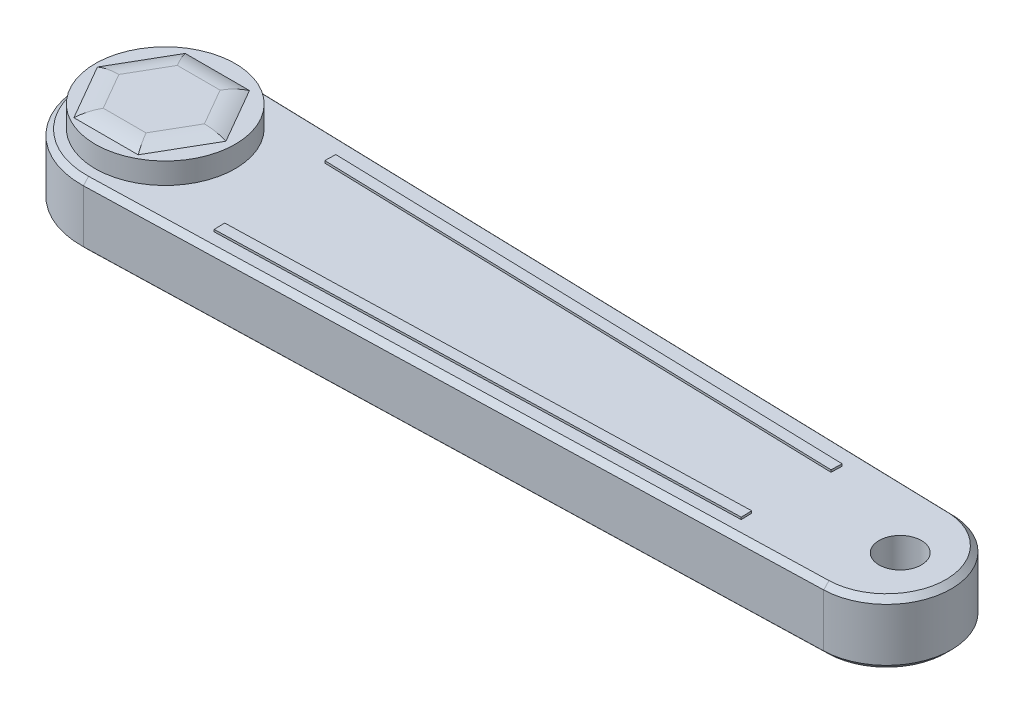
ISO-10303-21;
HEADER;
FILE_DESCRIPTION(('STEP AP214'),'2;1');
FILE_NAME('part.step','',(''),(''),'','','');
FILE_SCHEMA(('AUTOMOTIVE_DESIGN { 1 0 10303 214 1 1 1 1 }'));
ENDSEC;
DATA;
#1=APPLICATION_CONTEXT('core data for automotive mechanical design processes');
#2=APPLICATION_PROTOCOL_DEFINITION('international standard','automotive_design',2000,#1);
#3=PRODUCT_CONTEXT('',#1,'mechanical');
#4=PRODUCT('Part','Part','',(#3));
#5=PRODUCT_RELATED_PRODUCT_CATEGORY('part','',(#4));
#6=PRODUCT_DEFINITION_FORMATION('','',#4);
#7=PRODUCT_DEFINITION_CONTEXT('part definition',#1,'design');
#8=PRODUCT_DEFINITION('design','',#6,#7);
#9=PRODUCT_DEFINITION_SHAPE('','',#8);
#10=(LENGTH_UNIT() NAMED_UNIT(*) SI_UNIT(.MILLI.,.METRE.));
#11=(NAMED_UNIT(*) PLANE_ANGLE_UNIT() SI_UNIT($,.RADIAN.));
#12=(NAMED_UNIT(*) SI_UNIT($,.STERADIAN.) SOLID_ANGLE_UNIT());
#13=UNCERTAINTY_MEASURE_WITH_UNIT(LENGTH_MEASURE(1.E-05),#10,'distance_accuracy_value','');
#14=(GEOMETRIC_REPRESENTATION_CONTEXT(3) GLOBAL_UNCERTAINTY_ASSIGNED_CONTEXT((#13)) GLOBAL_UNIT_ASSIGNED_CONTEXT((#10,
#11,#12)) REPRESENTATION_CONTEXT('',''));
#15=CARTESIAN_POINT('',(0.,0.,0.));
#16=DIRECTION('',(0.,0.,1.));
#17=DIRECTION('',(1.,0.,0.));
#18=AXIS2_PLACEMENT_3D('',#15,#16,#17);
#19=CARTESIAN_POINT('',(-75.7351713633189,7.5,0.692096021935247));
#20=DIRECTION('',(0.,1.,0.));
#21=DIRECTION('',(0.,0.,1.));
#22=AXIS2_PLACEMENT_3D('',#19,#20,#21);
#23=PLANE('',#22);
#24=CARTESIAN_POINT('',(97.3689857761873,7.5,0.58011820055873));
#25=DIRECTION('',(0.,1.,0.));
#26=DIRECTION('',(0.,0.,1.));
#27=AXIS2_PLACEMENT_3D('',#24,#25,#26);
#28=CIRCLE('',#27,5.);
#29=CARTESIAN_POINT('',(97.3689857761873,7.5,5.58011820055873));
#30=VERTEX_POINT('',#29);
#31=EDGE_CURVE('E316',#30,#30,#28,.T.);
#32=ORIENTED_EDGE('',*,*,#31,.F.);
#33=EDGE_LOOP('',(#32));
#34=FACE_BOUND('',#33,.T.);
#35=CARTESIAN_POINT('',(-75.9726817145849,7.5,0.58011820055873));
#36=DIRECTION('',(0.,1.,0.));
#37=DIRECTION('',(0.,0.,1.));
#38=AXIS2_PLACEMENT_3D('',#35,#36,#37);
#39=CIRCLE('',#38,16.5);
#40=CARTESIAN_POINT('',(-75.9726817145849,7.5,17.0801182005587));
#41=VERTEX_POINT('',#40);
#42=EDGE_CURVE('E321',#41,#41,#39,.T.);
#43=ORIENTED_EDGE('',*,*,#42,.F.);
#44=EDGE_LOOP('',(#43));
#45=FACE_BOUND('',#44,.T.);
#46=CARTESIAN_POINT('',(94.2648286366812,7.5,0.692096021935247));
#47=DIRECTION('',(0.,1.,0.));
#48=DIRECTION('',(0.,0.,1.));
#49=AXIS2_PLACEMENT_3D('',#46,#47,#48);
#50=CIRCLE('',#49,13.9821549346402);
#51=CARTESIAN_POINT('',(94.655329256149,7.5,14.6687968444641));
#52=VERTEX_POINT('',#51);
#53=CARTESIAN_POINT('',(93.6992779179762,7.5,-13.2786165225579));
#54=VERTEX_POINT('',#53);
#55=EDGE_CURVE('E360',#52,#54,#50,.T.);
#56=ORIENTED_EDGE('',*,*,#55,.T.);
#57=DIRECTION('',(-0.999604502122998,0.,-0.0281218657886265));
#58=VECTOR('',#57,1.);
#59=CARTESIAN_POINT('',(-75.2084488170979,7.5,-18.0304963028285));
#60=LINE('',#59,#58);
#61=CARTESIAN_POINT('',(-75.2084488170979,7.5,-18.0304963028285));
#62=VERTEX_POINT('',#61);
#63=EDGE_CURVE('E363',#54,#62,#60,.T.);
#64=ORIENTED_EDGE('',*,*,#63,.T.);
#65=CARTESIAN_POINT('',(-75.7351713633189,7.5,0.692096021935247));
#66=DIRECTION('',(0.,1.,0.));
#67=DIRECTION('',(0.,0.,1.));
#68=AXIS2_PLACEMENT_3D('',#65,#66,#67);
#69=CIRCLE('',#68,18.73);
#70=CARTESIAN_POINT('',(-75.2120705511177,7.5,19.4147898863415));
#71=VERTEX_POINT('',#70);
#72=EDGE_CURVE('E354',#62,#71,#69,.T.);
#73=ORIENTED_EDGE('',*,*,#72,.T.);
#74=DIRECTION('',(0.999609923353242,0.,-0.027928500384469));
#75=VECTOR('',#74,1.);
#76=CARTESIAN_POINT('',(94.655329256149,7.5,14.6687968444641));
#77=LINE('',#76,#75);
#78=EDGE_CURVE('E357',#71,#52,#77,.T.);
#79=ORIENTED_EDGE('',*,*,#78,.T.);
#80=EDGE_LOOP('',(#56,#64,#73,#79));
#81=FACE_BOUND('',#80,.T.);
#82=DIRECTION('',(-0.0281218657886358,0.,0.999604502122998));
#83=VECTOR('',#82,1.);
#84=CARTESIAN_POINT('',(72.855024799584,7.5,-10.2262007392061));
#85=LINE('',#84,#83);
#86=CARTESIAN_POINT('',(72.855024799584,7.5,-10.2262007392061));
#87=VERTEX_POINT('',#86);
#88=CARTESIAN_POINT('',(72.7835952604809,7.5,-7.68720530381367));
#89=VERTEX_POINT('',#88);
#90=EDGE_CURVE('E265',#87,#89,#85,.T.);
#91=ORIENTED_EDGE('',*,*,#90,.T.);
#92=DIRECTION('',(0.999604502122998,0.,0.0281218657886265));
#93=VECTOR('',#92,1.);
#94=CARTESIAN_POINT('',(-50.0735407064503,7.5,-11.1435441673335));
#95=LINE('',#94,#93);
#96=CARTESIAN_POINT('',(-50.0735407064503,7.5,-11.1435441673335));
#97=VERTEX_POINT('',#96);
#98=EDGE_CURVE('E261',#97,#89,#95,.T.);
#99=ORIENTED_EDGE('',*,*,#98,.F.);
#100=DIRECTION('',(0.0281218657886276,0.,-0.999604502122998));
#101=VECTOR('',#100,1.);
#102=CARTESIAN_POINT('',(-50.0735407064503,7.5,-11.1435441673335));
#103=LINE('',#102,#101);
#104=CARTESIAN_POINT('',(-50.0021111673472,7.5,-13.6825396027259));
#105=VERTEX_POINT('',#104);
#106=EDGE_CURVE('E248',#97,#105,#103,.T.);
#107=ORIENTED_EDGE('',*,*,#106,.T.);
#108=DIRECTION('',(0.999604502122998,0.,0.0281218657886265));
#109=VECTOR('',#108,1.);
#110=CARTESIAN_POINT('',(-50.0021111673472,7.5,-13.6825396027259));
#111=LINE('',#110,#109);
#112=EDGE_CURVE('E268',#105,#87,#111,.T.);
#113=ORIENTED_EDGE('',*,*,#112,.T.);
#114=EDGE_LOOP('',(#91,#99,#107,#113));
#115=FACE_BOUND('',#114,.T.);
#116=DIRECTION('',(0.0279285003844791,0.,0.999609923353242));
#117=VECTOR('',#116,1.);
#118=CARTESIAN_POINT('',(71.7924675290524,7.5,10.0324460474998));
#119=LINE('',#118,#117);
#120=CARTESIAN_POINT('',(71.7924675290524,7.5,10.0324460474998));
#121=VERTEX_POINT('',#120);
#122=CARTESIAN_POINT('',(71.863405920029,7.5,12.5714552528171));
#123=VERTEX_POINT('',#122);
#124=EDGE_CURVE('E61',#121,#123,#119,.T.);
#125=ORIENTED_EDGE('',*,*,#124,.T.);
#126=DIRECTION('',(0.999609923353242,0.,-0.0279285003844691));
#127=VECTOR('',#126,1.);
#128=CARTESIAN_POINT('',(-49.0565280584508,7.5,15.9498855221758));
#129=LINE('',#128,#127);
#130=CARTESIAN_POINT('',(-49.0565280584508,7.5,15.9498855221758));
#131=VERTEX_POINT('',#130);
#132=EDGE_CURVE('E212',#131,#123,#129,.T.);
#133=ORIENTED_EDGE('',*,*,#132,.F.);
#134=DIRECTION('',(-0.0279285003844682,0.,-0.999609923353242));
#135=VECTOR('',#134,1.);
#136=CARTESIAN_POINT('',(-49.0565280584508,7.5,15.9498855221758));
#137=LINE('',#136,#135);
#138=CARTESIAN_POINT('',(-49.1274664494273,7.5,13.4108763168585));
#139=VERTEX_POINT('',#138);
#140=EDGE_CURVE('E207',#131,#139,#137,.T.);
#141=ORIENTED_EDGE('',*,*,#140,.T.);
#142=DIRECTION('',(0.999609923353242,0.,-0.0279285003844691));
#143=VECTOR('',#142,1.);
#144=CARTESIAN_POINT('',(-49.1274664494273,7.5,13.4108763168585));
#145=LINE('',#144,#143);
#146=EDGE_CURVE('E66',#139,#121,#145,.T.);
#147=ORIENTED_EDGE('',*,*,#146,.T.);
#148=EDGE_LOOP('',(#125,#133,#141,#147));
#149=FACE_BOUND('',#148,.T.);
#150=ADVANCED_FACE('F43',(#34,#45,#81,#115,#149),#23,.T.);
#151=CARTESIAN_POINT('',(-75.7351713633189,7.5,0.692096021935247));
#152=DIRECTION('',(0.,-1.,0.));
#153=DIRECTION('',(0.,0.,-1.));
#154=AXIS2_PLACEMENT_3D('',#151,#152,#153);
#155=CYLINDRICAL_SURFACE('',#154,20.);
#156=DIRECTION('',(0.,-1.,0.));
#157=VECTOR('',#156,1.);
#158=CARTESIAN_POINT('',(-75.1727340475463,7.5,-19.2999940205247));
#159=LINE('',#158,#157);
#160=CARTESIAN_POINT('',(-75.1727340475463,6.22999999999998,-19.2999940205247));
#161=VERTEX_POINT('',#160);
#162=CARTESIAN_POINT('',(-75.1727340475463,-6.22999999999998,-19.2999940205247));
#163=VERTEX_POINT('',#162);
#164=EDGE_CURVE('E333',#161,#163,#159,.T.);
#165=ORIENTED_EDGE('',*,*,#164,.T.);
#166=CARTESIAN_POINT('',(-75.7351713633189,-6.22999999999998,0.692096021935247));
#167=DIRECTION('',(0.,1.,0.));
#168=DIRECTION('',(0.,0.,1.));
#169=AXIS2_PLACEMENT_3D('',#166,#167,#168);
#170=CIRCLE('',#169,20.);
#171=CARTESIAN_POINT('',(-75.1766013556295,-6.22999999999998,20.6842944890001));
#172=VERTEX_POINT('',#171);
#173=EDGE_CURVE('E457',#163,#172,#170,.T.);
#174=ORIENTED_EDGE('',*,*,#173,.T.);
#175=DIRECTION('',(0.,-1.,0.));
#176=VECTOR('',#175,1.);
#177=CARTESIAN_POINT('',(-75.1766013556295,7.5,20.6842944890001));
#178=LINE('',#177,#176);
#179=CARTESIAN_POINT('',(-75.1766013556295,6.22999999999998,20.6842944890001));
#180=VERTEX_POINT('',#179);
#181=EDGE_CURVE('E346',#180,#172,#178,.T.);
#182=ORIENTED_EDGE('',*,*,#181,.F.);
#183=CARTESIAN_POINT('',(-75.7351713633189,6.22999999999998,0.692096021935247));
#184=DIRECTION('',(0.,1.,0.));
#185=DIRECTION('',(0.,0.,1.));
#186=AXIS2_PLACEMENT_3D('',#183,#184,#185);
#187=CIRCLE('',#186,20.);
#188=EDGE_CURVE('E373',#180,#161,#187,.F.);
#189=ORIENTED_EDGE('',*,*,#188,.T.);
#190=EDGE_LOOP('',(#165,#174,#182,#189));
#191=FACE_BOUND('',#190,.T.);
#192=ADVANCED_FACE('F526',(#191),#155,.T.);
#193=CARTESIAN_POINT('',(-75.1766013556295,7.5,20.6842944890001));
#194=DIRECTION('',(-0.027928500384469,0.,-0.999609923353242));
#195=DIRECTION('',(-0.999609923353242,0.,0.027928500384469));
#196=AXIS2_PLACEMENT_3D('',#193,#194,#195);
#197=PLANE('',#196);
#198=ORIENTED_EDGE('',*,*,#181,.T.);
#199=DIRECTION('',(0.999609923353242,0.,-0.027928500384469));
#200=VECTOR('',#199,1.);
#201=CARTESIAN_POINT('',(-75.1766013556295,-6.22999999999998,20.6842944890001));
#202=LINE('',#201,#200);
#203=CARTESIAN_POINT('',(94.6907984516372,-6.22999999999998,15.9383014471228));
#204=VERTEX_POINT('',#203);
#205=EDGE_CURVE('E376',#172,#204,#202,.T.);
#206=ORIENTED_EDGE('',*,*,#205,.T.);
#207=DIRECTION('',(0.,-1.,0.));
#208=VECTOR('',#207,1.);
#209=CARTESIAN_POINT('',(94.6907984516372,7.5,15.9383014471228));
#210=LINE('',#209,#208);
#211=CARTESIAN_POINT('',(94.6907984516372,6.22999999999998,15.9383014471228));
#212=VERTEX_POINT('',#211);
#213=EDGE_CURVE('E342',#212,#204,#210,.T.);
#214=ORIENTED_EDGE('',*,*,#213,.F.);
#215=DIRECTION('',(-0.999609923353242,0.,0.027928500384469));
#216=VECTOR('',#215,1.);
#217=CARTESIAN_POINT('',(-75.1766013556295,6.22999999999998,20.6842944890001));
#218=LINE('',#217,#216);
#219=EDGE_CURVE('E370',#212,#180,#218,.T.);
#220=ORIENTED_EDGE('',*,*,#219,.T.);
#221=EDGE_LOOP('',(#198,#206,#214,#220));
#222=FACE_BOUND('',#221,.T.);
#223=ADVANCED_FACE('F532',(#222),#197,.F.);
#224=CARTESIAN_POINT('',(94.2648286366812,7.5,0.692096021935247));
#225=DIRECTION('',(0.,-1.,0.));
#226=DIRECTION('',(0.,0.,-1.));
#227=AXIS2_PLACEMENT_3D('',#224,#225,#226);
#228=CYLINDRICAL_SURFACE('',#227,15.2521549346403);
#229=ORIENTED_EDGE('',*,*,#213,.T.);
#230=CARTESIAN_POINT('',(94.2648286366812,-6.22999999999998,0.692096021935247));
#231=DIRECTION('',(0.,1.,0.));
#232=DIRECTION('',(0.,0.,1.));
#233=AXIS2_PLACEMENT_3D('',#230,#231,#232);
#234=CIRCLE('',#233,15.2521549346403);
#235=CARTESIAN_POINT('',(93.6923890765872,-6.22999999999998,-14.5493128073138));
#236=VERTEX_POINT('',#235);
#237=EDGE_CURVE('E585',#204,#236,#234,.T.);
#238=ORIENTED_EDGE('',*,*,#237,.T.);
#239=DIRECTION('',(0.,-1.,0.));
#240=VECTOR('',#239,1.);
#241=CARTESIAN_POINT('',(93.6923890765872,7.5,-14.5493128073138));
#242=LINE('',#241,#240);
#243=CARTESIAN_POINT('',(93.6923890765872,6.22999999999998,-14.5493128073138));
#244=VERTEX_POINT('',#243);
#245=EDGE_CURVE('E337',#244,#236,#242,.T.);
#246=ORIENTED_EDGE('',*,*,#245,.F.);
#247=CARTESIAN_POINT('',(94.2648286366812,6.22999999999998,0.692096021935247));
#248=DIRECTION('',(0.,1.,0.));
#249=DIRECTION('',(0.,0.,1.));
#250=AXIS2_PLACEMENT_3D('',#247,#248,#249);
#251=CIRCLE('',#250,15.2521549346403);
#252=EDGE_CURVE('E367',#244,#212,#251,.F.);
#253=ORIENTED_EDGE('',*,*,#252,.T.);
#254=EDGE_LOOP('',(#229,#238,#246,#253));
#255=FACE_BOUND('',#254,.T.);
#256=ADVANCED_FACE('F545',(#255),#228,.T.);
#257=CARTESIAN_POINT('',(-75.1727340475463,7.5,-19.2999940205247));
#258=DIRECTION('',(0.0281218657886265,0.,-0.999604502122998));
#259=DIRECTION('',(-0.999604502122998,0.,-0.0281218657886265));
#260=AXIS2_PLACEMENT_3D('',#257,#258,#259);
#261=PLANE('',#260);
#262=ORIENTED_EDGE('',*,*,#245,.T.);
#263=DIRECTION('',(-0.999604502122998,0.,-0.0281218657886265));
#264=VECTOR('',#263,1.);
#265=CARTESIAN_POINT('',(-75.1727340475463,-6.22999999999998,-19.2999940205247));
#266=LINE('',#265,#264);
#267=EDGE_CURVE('E588',#236,#163,#266,.T.);
#268=ORIENTED_EDGE('',*,*,#267,.T.);
#269=ORIENTED_EDGE('',*,*,#164,.F.);
#270=DIRECTION('',(0.999604502122998,0.,0.0281218657886265));
#271=VECTOR('',#270,1.);
#272=CARTESIAN_POINT('',(-75.1727340475463,6.22999999999998,-19.2999940205247));
#273=LINE('',#272,#271);
#274=EDGE_CURVE('E350',#161,#244,#273,.T.);
#275=ORIENTED_EDGE('',*,*,#274,.T.);
#276=EDGE_LOOP('',(#262,#268,#269,#275));
#277=FACE_BOUND('',#276,.T.);
#278=ADVANCED_FACE('F541',(#277),#261,.T.);
#279=CARTESIAN_POINT('',(-75.7351713633189,-7.5,0.692096021935247));
#280=DIRECTION('',(0.,1.,0.));
#281=DIRECTION('',(0.,0.,1.));
#282=AXIS2_PLACEMENT_3D('',#279,#280,#281);
#283=PLANE('',#282);
#284=CARTESIAN_POINT('',(-77.7643268566084,-7.5,0.));
#285=DIRECTION('',(0.,1.,0.));
#286=DIRECTION('',(0.,0.,1.));
#287=AXIS2_PLACEMENT_3D('',#284,#285,#286);
#288=CIRCLE('',#287,5.);
#289=CARTESIAN_POINT('',(-77.7643268566084,-7.5,5.));
#290=VERTEX_POINT('',#289);
#291=EDGE_CURVE('E452',#290,#290,#288,.F.);
#292=ORIENTED_EDGE('',*,*,#291,.F.);
#293=EDGE_LOOP('',(#292));
#294=FACE_BOUND('',#293,.T.);
#295=CARTESIAN_POINT('',(94.2648286366812,-7.5,0.692096021935247));
#296=DIRECTION('',(0.,1.,0.));
#297=DIRECTION('',(0.,0.,1.));
#298=AXIS2_PLACEMENT_3D('',#295,#296,#297);
#299=CIRCLE('',#298,13.9821549346402);
#300=CARTESIAN_POINT('',(93.6992779179762,-7.5,-13.2786165225578));
#301=VERTEX_POINT('',#300);
#302=CARTESIAN_POINT('',(94.655329256149,-7.5,14.6687968444641));
#303=VERTEX_POINT('',#302);
#304=EDGE_CURVE('E579',#301,#303,#299,.F.);
#305=ORIENTED_EDGE('',*,*,#304,.T.);
#306=DIRECTION('',(-0.999609923353242,0.,0.027928500384469));
#307=VECTOR('',#306,1.);
#308=CARTESIAN_POINT('',(-75.2120705511177,-7.5,19.4147898863414));
#309=LINE('',#308,#307);
#310=CARTESIAN_POINT('',(-75.2120705511177,-7.5,19.4147898863414));
#311=VERTEX_POINT('',#310);
#312=EDGE_CURVE('E582',#303,#311,#309,.T.);
#313=ORIENTED_EDGE('',*,*,#312,.T.);
#314=CARTESIAN_POINT('',(-75.7351713633189,-7.5,0.692096021935247));
#315=DIRECTION('',(0.,1.,0.));
#316=DIRECTION('',(0.,0.,1.));
#317=AXIS2_PLACEMENT_3D('',#314,#315,#316);
#318=CIRCLE('',#317,18.73);
#319=CARTESIAN_POINT('',(-75.2084488170979,-7.5,-18.0304963028285));
#320=VERTEX_POINT('',#319);
#321=EDGE_CURVE('E564',#311,#320,#318,.F.);
#322=ORIENTED_EDGE('',*,*,#321,.T.);
#323=DIRECTION('',(0.999604502122998,0.,0.0281218657886265));
#324=VECTOR('',#323,1.);
#325=CARTESIAN_POINT('',(93.6566743070357,-7.5,-13.2798150896176));
#326=LINE('',#325,#324);
#327=EDGE_CURVE('E573',#320,#301,#326,.T.);
#328=ORIENTED_EDGE('',*,*,#327,.T.);
#329=EDGE_LOOP('',(#305,#313,#322,#328));
#330=FACE_BOUND('',#329,.T.);
#331=ADVANCED_FACE('F414',(#294,#330),#283,.F.);
#332=CARTESIAN_POINT('',(-75.2120705511177,7.5,19.4147898863415));
#333=DIRECTION('',(0.0197484320102292,0.707106781186548,0.706830955344442));
#334=DIRECTION('',(-0.999609923353242,0.,0.027928500384469));
#335=AXIS2_PLACEMENT_3D('',#332,#333,#334);
#336=PLANE('',#335);
#337=DIRECTION('',(0.0197484320102282,-0.707106781186547,0.706830955344443));
#338=VECTOR('',#337,1.);
#339=CARTESIAN_POINT('',(94.655329256149,7.5,14.6687968444641));
#340=LINE('',#339,#338);
#341=EDGE_CURVE('E595',#52,#212,#340,.T.);
#342=ORIENTED_EDGE('',*,*,#341,.F.);
#343=ORIENTED_EDGE('',*,*,#78,.F.);
#344=DIRECTION('',(-0.0197484320102282,0.707106781186547,-0.706830955344443));
#345=VECTOR('',#344,1.);
#346=CARTESIAN_POINT('',(-75.1766013556295,6.22999999999998,20.6842944890001));
#347=LINE('',#346,#345);
#348=EDGE_CURVE('E338',#180,#71,#347,.T.);
#349=ORIENTED_EDGE('',*,*,#348,.F.);
#350=ORIENTED_EDGE('',*,*,#219,.F.);
#351=EDGE_LOOP('',(#342,#343,#349,#350));
#352=FACE_BOUND('',#351,.T.);
#353=ADVANCED_FACE('F408',(#352),#336,.T.);
#354=CARTESIAN_POINT('',(-75.7351713633189,7.5,0.692096021935247));
#355=DIRECTION('',(0.,-1.,0.));
#356=DIRECTION('',(0.,0.,-1.));
#357=AXIS2_PLACEMENT_3D('',#354,#355,#356);
#358=CONICAL_SURFACE('',#357,18.73,0.785398163397447);
#359=ORIENTED_EDGE('',*,*,#348,.T.);
#360=ORIENTED_EDGE('',*,*,#72,.F.);
#361=DIRECTION('',(-0.0198851619987543,0.707106781186548,0.706827121955774));
#362=VECTOR('',#361,1.);
#363=CARTESIAN_POINT('',(-75.1727340475463,6.22999999999998,-19.2999940205247));
#364=LINE('',#363,#362);
#365=EDGE_CURVE('E386',#161,#62,#364,.T.);
#366=ORIENTED_EDGE('',*,*,#365,.F.);
#367=ORIENTED_EDGE('',*,*,#188,.F.);
#368=EDGE_LOOP('',(#359,#360,#366,#367));
#369=FACE_BOUND('',#368,.T.);
#370=ADVANCED_FACE('F401',(#369),#358,.T.);
#371=CARTESIAN_POINT('',(94.2648286366812,7.5,0.692096021935247));
#372=DIRECTION('',(0.,-1.,0.));
#373=DIRECTION('',(0.,0.,-1.));
#374=AXIS2_PLACEMENT_3D('',#371,#372,#373);
#375=CONICAL_SURFACE('',#374,13.9821549346402,0.785398163397447);
#376=ORIENTED_EDGE('',*,*,#341,.T.);
#377=ORIENTED_EDGE('',*,*,#252,.F.);
#378=CARTESIAN_POINT('',(93.6923890765872,6.22999999999998,-14.5493128073138));
#379=CARTESIAN_POINT('',(93.6933827698741,6.44166925743186,-14.3375318464523));
#380=CARTESIAN_POINT('',(93.6944536866314,6.65333721917515,-14.1257500092646));
#381=CARTESIAN_POINT('',(93.6967499670935,7.07667055250851,-13.7021845810127));
#382=CARTESIAN_POINT('',(93.6979753307992,7.28833592409856,-13.4904009899483));
#383=CARTESIAN_POINT('',(93.6992779179762,7.5,-13.2786165225579));
#384=B_SPLINE_CURVE_WITH_KNOTS('',3,(#378,#379,#380,#381,#382,#383),.UNSPECIFIED.,.F.,.F.,(4,2,
4),(0.,0.898278450751407,1.79655690669711),.UNSPECIFIED.);
#385=EDGE_CURVE('E377',#54,#244,#384,.F.);
#386=ORIENTED_EDGE('',*,*,#385,.F.);
#387=ORIENTED_EDGE('',*,*,#55,.F.);
#388=EDGE_LOOP('',(#376,#377,#386,#387));
#389=FACE_BOUND('',#388,.T.);
#390=ADVANCED_FACE('F394',(#389),#375,.T.);
#391=CARTESIAN_POINT('',(-75.1727340475463,6.22999999999998,-19.2999940205247));
#392=DIRECTION('',(-0.0198851619987558,-0.707106781186547,0.706827121955775));
#393=DIRECTION('',(0.999604502122998,0.,0.0281218657886265));
#394=AXIS2_PLACEMENT_3D('',#391,#392,#393);
#395=PLANE('',#394);
#396=ORIENTED_EDGE('',*,*,#365,.T.);
#397=ORIENTED_EDGE('',*,*,#63,.F.);
#398=ORIENTED_EDGE('',*,*,#385,.T.);
#399=ORIENTED_EDGE('',*,*,#274,.F.);
#400=EDGE_LOOP('',(#396,#397,#398,#399));
#401=FACE_BOUND('',#400,.T.);
#402=ADVANCED_FACE('F390',(#401),#395,.F.);
#403=CARTESIAN_POINT('',(-75.2084488170979,-7.5,-18.0304963028285));
#404=DIRECTION('',(0.0198851619987557,-0.707106781186551,-0.706827121955771));
#405=DIRECTION('',(-0.999604502122998,0.,-0.0281218657886265));
#406=AXIS2_PLACEMENT_3D('',#403,#404,#405);
#407=PLANE('',#406);
#408=CARTESIAN_POINT('',(93.6923890765872,-6.22999999999998,-14.5493128073138));
#409=CARTESIAN_POINT('',(93.6933827698741,-6.44166925743186,-14.3375318464522));
#410=CARTESIAN_POINT('',(93.6944536866314,-6.65333721917515,-14.1257500092646));
#411=CARTESIAN_POINT('',(93.6967499670935,-7.07667055250851,-13.7021845810127));
#412=CARTESIAN_POINT('',(93.6979753307992,-7.28833592409856,-13.4904009899483));
#413=CARTESIAN_POINT('',(93.6992779179762,-7.5,-13.2786165225578));
#414=B_SPLINE_CURVE_WITH_KNOTS('',3,(#408,#409,#410,#411,#412,#413),.UNSPECIFIED.,.F.,.F.,(4,2,
4),(0.,0.898278450751416,1.79655690669712),.UNSPECIFIED.);
#415=EDGE_CURVE('E438',#301,#236,#414,.F.);
#416=ORIENTED_EDGE('',*,*,#415,.F.);
#417=ORIENTED_EDGE('',*,*,#327,.F.);
#418=DIRECTION('',(-0.0198851619987542,-0.707106781186544,0.706827121955778));
#419=VECTOR('',#418,1.);
#420=CARTESIAN_POINT('',(-75.1727340475463,-6.22999999999998,-19.2999940205247));
#421=LINE('',#420,#419);
#422=EDGE_CURVE('E387',#163,#320,#421,.T.);
#423=ORIENTED_EDGE('',*,*,#422,.F.);
#424=ORIENTED_EDGE('',*,*,#267,.F.);
#425=EDGE_LOOP('',(#416,#417,#423,#424));
#426=FACE_BOUND('',#425,.T.);
#427=ADVANCED_FACE('F434',(#426),#407,.T.);
#428=CARTESIAN_POINT('',(-75.7351713633189,-6.22999999999998,0.692096021935247));
#429=DIRECTION('',(0.,1.,0.));
#430=DIRECTION('',(0.,0.,1.));
#431=AXIS2_PLACEMENT_3D('',#428,#429,#430);
#432=CONICAL_SURFACE('',#431,20.,0.785398163397452);
#433=ORIENTED_EDGE('',*,*,#422,.T.);
#434=ORIENTED_EDGE('',*,*,#321,.F.);
#435=DIRECTION('',(-0.0197484320102282,-0.707106781186544,-0.706830955344446));
#436=VECTOR('',#435,1.);
#437=CARTESIAN_POINT('',(-75.1766013556295,-6.22999999999998,20.6842944890001));
#438=LINE('',#437,#436);
#439=EDGE_CURVE('E447',#172,#311,#438,.T.);
#440=ORIENTED_EDGE('',*,*,#439,.F.);
#441=ORIENTED_EDGE('',*,*,#173,.F.);
#442=EDGE_LOOP('',(#433,#434,#440,#441));
#443=FACE_BOUND('',#442,.T.);
#444=ADVANCED_FACE('F432',(#443),#432,.T.);
#445=CARTESIAN_POINT('',(94.2648286366812,-6.22999999999998,0.692096021935247));
#446=DIRECTION('',(0.,1.,0.));
#447=DIRECTION('',(0.,0.,1.));
#448=AXIS2_PLACEMENT_3D('',#445,#446,#447);
#449=CONICAL_SURFACE('',#448,15.2521549346403,0.785398163397452);
#450=ORIENTED_EDGE('',*,*,#415,.T.);
#451=ORIENTED_EDGE('',*,*,#237,.F.);
#452=DIRECTION('',(0.0197484320102282,0.707106781186544,0.706830955344446));
#453=VECTOR('',#452,1.);
#454=CARTESIAN_POINT('',(94.655329256149,-7.5,14.6687968444641));
#455=LINE('',#454,#453);
#456=EDGE_CURVE('E329',#303,#204,#455,.T.);
#457=ORIENTED_EDGE('',*,*,#456,.F.);
#458=ORIENTED_EDGE('',*,*,#304,.F.);
#459=EDGE_LOOP('',(#450,#451,#457,#458));
#460=FACE_BOUND('',#459,.T.);
#461=ADVANCED_FACE('F424',(#460),#449,.T.);
#462=CARTESIAN_POINT('',(-75.1766013556295,-6.22999999999998,20.6842944890001));
#463=DIRECTION('',(-0.0197484320102291,0.707106781186551,-0.70683095534444));
#464=DIRECTION('',(0.999609923353242,0.,-0.027928500384469));
#465=AXIS2_PLACEMENT_3D('',#462,#463,#464);
#466=PLANE('',#465);
#467=ORIENTED_EDGE('',*,*,#439,.T.);
#468=ORIENTED_EDGE('',*,*,#312,.F.);
#469=ORIENTED_EDGE('',*,*,#456,.T.);
#470=ORIENTED_EDGE('',*,*,#205,.F.);
#471=EDGE_LOOP('',(#467,#468,#469,#470));
#472=FACE_BOUND('',#471,.T.);
#473=ADVANCED_FACE('F417',(#472),#466,.F.);
#474=CARTESIAN_POINT('',(-75.9726817145849,12.5,0.58011820055873));
#475=DIRECTION('',(0.,-1.,0.));
#476=DIRECTION('',(0.,0.,-1.));
#477=AXIS2_PLACEMENT_3D('',#474,#475,#476);
#478=CYLINDRICAL_SURFACE('',#477,16.5);
#479=CARTESIAN_POINT('',(-75.9726817145849,12.5,0.58011820055873));
#480=DIRECTION('',(0.,1.,0.));
#481=DIRECTION('',(0.,0.,1.));
#482=AXIS2_PLACEMENT_3D('',#479,#480,#481);
#483=CIRCLE('',#482,16.5);
#484=CARTESIAN_POINT('',(-75.9726817145849,12.5,17.0801182005587));
#485=VERTEX_POINT('',#484);
#486=EDGE_CURVE('E325',#485,#485,#483,.T.);
#487=ORIENTED_EDGE('',*,*,#486,.F.);
#488=EDGE_LOOP('',(#487));
#489=FACE_BOUND('',#488,.T.);
#490=ORIENTED_EDGE('',*,*,#42,.T.);
#491=EDGE_LOOP('',(#490));
#492=FACE_BOUND('',#491,.T.);
#493=ADVANCED_FACE('F423',(#489,#492),#478,.T.);
#494=CARTESIAN_POINT('',(-75.9726817145849,12.5,0.58011820055873));
#495=DIRECTION('',(0.,1.,0.));
#496=DIRECTION('',(0.,0.,1.));
#497=AXIS2_PLACEMENT_3D('',#494,#495,#496);
#498=PLANE('',#497);
#499=DIRECTION('',(-0.500000000000001,0.,-0.866025403784438));
#500=VECTOR('',#499,1.);
#501=CARTESIAN_POINT('',(-61.1958432699661,12.5,1.04546654530198));
#502=LINE('',#501,#500);
#503=CARTESIAN_POINT('',(-61.1958432699661,12.5,1.04546654530198));
#504=VERTEX_POINT('',#503);
#505=CARTESIAN_POINT('',(-68.774877374267,12.5,-12.0818055956443));
#506=VERTEX_POINT('',#505);
#507=EDGE_CURVE('E288',#504,#506,#502,.T.);
#508=ORIENTED_EDGE('',*,*,#507,.F.);
#509=DIRECTION('',(0.499999999999999,0.,-0.866025403784439));
#510=VECTOR('',#509,1.);
#511=CARTESIAN_POINT('',(-68.774877374267,12.5,14.1727386862483));
#512=LINE('',#511,#510);
#513=CARTESIAN_POINT('',(-68.774877374267,12.5,14.1727386862483));
#514=VERTEX_POINT('',#513);
#515=EDGE_CURVE('E308',#514,#504,#512,.T.);
#516=ORIENTED_EDGE('',*,*,#515,.F.);
#517=DIRECTION('',(1.,0.,0.));
#518=VECTOR('',#517,1.);
#519=CARTESIAN_POINT('',(-83.9329455828686,12.5,14.1727386862483));
#520=LINE('',#519,#518);
#521=CARTESIAN_POINT('',(-83.9329455828686,12.5,14.1727386862483));
#522=VERTEX_POINT('',#521);
#523=EDGE_CURVE('E304',#522,#514,#520,.T.);
#524=ORIENTED_EDGE('',*,*,#523,.F.);
#525=DIRECTION('',(0.5,0.,0.866025403784439));
#526=VECTOR('',#525,1.);
#527=CARTESIAN_POINT('',(-91.5119796871695,12.5,1.04546654530198));
#528=LINE('',#527,#526);
#529=CARTESIAN_POINT('',(-91.5119796871695,12.5,1.04546654530198));
#530=VERTEX_POINT('',#529);
#531=EDGE_CURVE('E300',#530,#522,#528,.T.);
#532=ORIENTED_EDGE('',*,*,#531,.F.);
#533=DIRECTION('',(-0.500000000000001,0.,0.866025403784438));
#534=VECTOR('',#533,1.);
#535=CARTESIAN_POINT('',(-83.9329455828687,12.5,-12.0818055956443));
#536=LINE('',#535,#534);
#537=CARTESIAN_POINT('',(-83.9329455828687,12.5,-12.0818055956443));
#538=VERTEX_POINT('',#537);
#539=EDGE_CURVE('E296',#538,#530,#536,.T.);
#540=ORIENTED_EDGE('',*,*,#539,.F.);
#541=DIRECTION('',(-1.,0.,0.));
#542=VECTOR('',#541,1.);
#543=CARTESIAN_POINT('',(-68.774877374267,12.5,-12.0818055956443));
#544=LINE('',#543,#542);
#545=EDGE_CURVE('E292',#506,#538,#544,.T.);
#546=ORIENTED_EDGE('',*,*,#545,.F.);
#547=EDGE_LOOP('',(#508,#516,#524,#532,#540,#546));
#548=FACE_BOUND('',#547,.T.);
#549=ORIENTED_EDGE('',*,*,#486,.T.);
#550=EDGE_LOOP('',(#549));
#551=FACE_BOUND('',#550,.T.);
#552=ADVANCED_FACE('F499',(#548,#551),#498,.T.);
#553=CARTESIAN_POINT('',(97.3689857761873,-2.5,0.58011820055873));
#554=DIRECTION('',(0.,1.,0.));
#555=DIRECTION('',(0.,0.,1.));
#556=AXIS2_PLACEMENT_3D('',#553,#554,#555);
#557=CYLINDRICAL_SURFACE('',#556,5.);
#558=CARTESIAN_POINT('',(97.3689857761873,-2.5,0.58011820055873));
#559=DIRECTION('',(0.,1.,0.));
#560=DIRECTION('',(0.,0.,1.));
#561=AXIS2_PLACEMENT_3D('',#558,#559,#560);
#562=CIRCLE('',#561,5.);
#563=CARTESIAN_POINT('',(97.3689857761873,-2.5,5.58011820055873));
#564=VERTEX_POINT('',#563);
#565=EDGE_CURVE('E317',#564,#564,#562,.T.);
#566=ORIENTED_EDGE('',*,*,#565,.F.);
#567=EDGE_LOOP('',(#566));
#568=FACE_BOUND('',#567,.T.);
#569=ORIENTED_EDGE('',*,*,#31,.T.);
#570=EDGE_LOOP('',(#569));
#571=FACE_BOUND('',#570,.T.);
#572=ADVANCED_FACE('F713',(#568,#571),#557,.F.);
#573=CARTESIAN_POINT('',(97.3689857761873,-2.5,0.58011820055873));
#574=DIRECTION('',(0.,1.,0.));
#575=DIRECTION('',(0.,0.,1.));
#576=AXIS2_PLACEMENT_3D('',#573,#574,#575);
#577=PLANE('',#576);
#578=ORIENTED_EDGE('',*,*,#565,.T.);
#579=EDGE_LOOP('',(#578));
#580=FACE_BOUND('',#579,.T.);
#581=ADVANCED_FACE('F721',(#580),#577,.T.);
#582=CARTESIAN_POINT('',(-77.7643268566084,-17.5,0.));
#583=DIRECTION('',(0.,1.,0.));
#584=DIRECTION('',(0.,0.,1.));
#585=AXIS2_PLACEMENT_3D('',#582,#583,#584);
#586=CYLINDRICAL_SURFACE('',#585,5.);
#587=CARTESIAN_POINT('',(-77.7643268566084,-17.5,0.));
#588=DIRECTION('',(0.,-1.,0.));
#589=DIRECTION('',(0.,0.,-1.));
#590=AXIS2_PLACEMENT_3D('',#587,#588,#589);
#591=CIRCLE('',#590,5.);
#592=CARTESIAN_POINT('',(-77.7643268566084,-17.5,-5.));
#593=VERTEX_POINT('',#592);
#594=EDGE_CURVE('E312',#593,#593,#591,.T.);
#595=ORIENTED_EDGE('',*,*,#594,.F.);
#596=EDGE_LOOP('',(#595));
#597=FACE_BOUND('',#596,.T.);
#598=ORIENTED_EDGE('',*,*,#291,.T.);
#599=EDGE_LOOP('',(#598));
#600=FACE_BOUND('',#599,.T.);
#601=ADVANCED_FACE('F729',(#597,#600),#586,.T.);
#602=CARTESIAN_POINT('',(-77.7643268566084,-17.5,0.));
#603=DIRECTION('',(0.,-1.,0.));
#604=DIRECTION('',(0.,0.,-1.));
#605=AXIS2_PLACEMENT_3D('',#602,#603,#604);
#606=PLANE('',#605);
#607=ORIENTED_EDGE('',*,*,#594,.T.);
#608=EDGE_LOOP('',(#607));
#609=FACE_BOUND('',#608,.T.);
#610=ADVANCED_FACE('F737',(#609),#606,.T.);
#611=CARTESIAN_POINT('',(0.,13.516,0.));
#612=DIRECTION('',(0.,1.,0.));
#613=DIRECTION('',(0.,0.,1.));
#614=AXIS2_PLACEMENT_3D('',#611,#612,#613);
#615=PLANE('',#614);
#616=DIRECTION('',(-1.,0.,0.));
#617=VECTOR('',#616,1.);
#618=CARTESIAN_POINT('',(-68.774877374267,13.516,9.78095727092265));
#619=LINE('',#618,#617);
#620=CARTESIAN_POINT('',(-81.3973494005084,13.516,9.78095727092265));
#621=VERTEX_POINT('',#620);
#622=CARTESIAN_POINT('',(-71.3104735566272,13.516,9.78095727092265));
#623=VERTEX_POINT('',#622);
#624=EDGE_CURVE('E53',#621,#623,#619,.F.);
#625=ORIENTED_EDGE('',*,*,#624,.T.);
#626=DIRECTION('',(-0.499999999999999,0.,0.866025403784439));
#627=VECTOR('',#626,1.);
#628=CARTESIAN_POINT('',(-72.5782716478074,13.516,11.9768479785855));
#629=LINE('',#628,#627);
#630=CARTESIAN_POINT('',(-66.2670356346867,13.516,1.04546654530199));
#631=VERTEX_POINT('',#630);
#632=EDGE_CURVE('E11',#623,#631,#629,.F.);
#633=ORIENTED_EDGE('',*,*,#632,.T.);
#634=DIRECTION('',(0.500000000000001,0.,0.866025403784438));
#635=VECTOR('',#634,1.);
#636=CARTESIAN_POINT('',(-72.5782716478074,13.516,-9.8859148879815));
#637=LINE('',#636,#635);
#638=CARTESIAN_POINT('',(-71.3104735566272,13.516,-7.69002418031865));
#639=VERTEX_POINT('',#638);
#640=EDGE_CURVE('E456',#631,#639,#637,.F.);
#641=ORIENTED_EDGE('',*,*,#640,.T.);
#642=DIRECTION('',(1.,0.,0.));
#643=VECTOR('',#642,1.);
#644=CARTESIAN_POINT('',(-83.9329455828687,13.516,-7.6900241803186));
#645=LINE('',#644,#643);
#646=CARTESIAN_POINT('',(-81.3973494005084,13.516,-7.69002418031861));
#647=VERTEX_POINT('',#646);
#648=EDGE_CURVE('E460',#639,#647,#645,.F.);
#649=ORIENTED_EDGE('',*,*,#648,.T.);
#650=DIRECTION('',(0.500000000000001,0.,-0.866025403784438));
#651=VECTOR('',#650,1.);
#652=CARTESIAN_POINT('',(-87.7085854136291,13.516,3.24135725296483));
#653=LINE('',#652,#651);
#654=CARTESIAN_POINT('',(-86.4407873224489,13.516,1.04546654530198));
#655=VERTEX_POINT('',#654);
#656=EDGE_CURVE('E463',#647,#655,#653,.F.);
#657=ORIENTED_EDGE('',*,*,#656,.T.);
#658=DIRECTION('',(-0.5,0.,-0.866025403784439));
#659=VECTOR('',#658,1.);
#660=CARTESIAN_POINT('',(-80.1295513093282,13.516,11.9768479785855));
#661=LINE('',#660,#659);
#662=EDGE_CURVE('E466',#655,#621,#661,.F.);
#663=ORIENTED_EDGE('',*,*,#662,.T.);
#664=EDGE_LOOP('',(#625,#633,#641,#649,#657,#663));
#665=FACE_BOUND('',#664,.T.);
#666=ADVANCED_FACE('F509',(#665),#615,.T.);
#667=CARTESIAN_POINT('',(-50.0735407064503,8.008,-11.1435441673335));
#668=DIRECTION('',(0.0281218657886265,0.,-0.999604502122998));
#669=DIRECTION('',(-0.999604502122998,0.,-0.0281218657886265));
#670=AXIS2_PLACEMENT_3D('',#667,#668,#669);
#671=PLANE('',#670);
#672=ORIENTED_EDGE('',*,*,#98,.T.);
#673=DIRECTION('',(0.,-1.,0.));
#674=VECTOR('',#673,1.);
#675=CARTESIAN_POINT('',(72.7835952604809,8.008,-7.68720530381367));
#676=LINE('',#675,#674);
#677=CARTESIAN_POINT('',(72.7835952604809,8.008,-7.68720530381367));
#678=VERTEX_POINT('',#677);
#679=EDGE_CURVE('E284',#678,#89,#676,.T.);
#680=ORIENTED_EDGE('',*,*,#679,.F.);
#681=DIRECTION('',(0.999604502122998,0.,0.0281218657886265));
#682=VECTOR('',#681,1.);
#683=CARTESIAN_POINT('',(-50.0735407064503,8.008,-11.1435441673335));
#684=LINE('',#683,#682);
#685=CARTESIAN_POINT('',(-50.0735407064503,8.008,-11.1435441673335));
#686=VERTEX_POINT('',#685);
#687=EDGE_CURVE('E244',#686,#678,#684,.T.);
#688=ORIENTED_EDGE('',*,*,#687,.F.);
#689=DIRECTION('',(0.,-1.,0.));
#690=VECTOR('',#689,1.);
#691=CARTESIAN_POINT('',(-50.0735407064503,8.008,-11.1435441673335));
#692=LINE('',#691,#690);
#693=EDGE_CURVE('E260',#686,#97,#692,.T.);
#694=ORIENTED_EDGE('',*,*,#693,.T.);
#695=EDGE_LOOP('',(#672,#680,#688,#694));
#696=FACE_BOUND('',#695,.T.);
#697=ADVANCED_FACE('F754',(#696),#671,.F.);
#698=CARTESIAN_POINT('',(72.855024799584,8.008,-10.2262007392061));
#699=DIRECTION('',(0.999604502122998,0.,0.0281218657886358));
#700=DIRECTION('',(0.0281218657886358,0.,-0.999604502122998));
#701=AXIS2_PLACEMENT_3D('',#698,#699,#700);
#702=PLANE('',#701);
#703=ORIENTED_EDGE('',*,*,#90,.F.);
#704=DIRECTION('',(0.,-1.,0.));
#705=VECTOR('',#704,1.);
#706=CARTESIAN_POINT('',(72.855024799584,8.008,-10.2262007392061));
#707=LINE('',#706,#705);
#708=CARTESIAN_POINT('',(72.855024799584,8.008,-10.2262007392061));
#709=VERTEX_POINT('',#708);
#710=EDGE_CURVE('E280',#709,#87,#707,.T.);
#711=ORIENTED_EDGE('',*,*,#710,.F.);
#712=DIRECTION('',(-0.0281218657886358,0.,0.999604502122998));
#713=VECTOR('',#712,1.);
#714=CARTESIAN_POINT('',(72.855024799584,8.008,-10.2262007392061));
#715=LINE('',#714,#713);
#716=EDGE_CURVE('E247',#709,#678,#715,.T.);
#717=ORIENTED_EDGE('',*,*,#716,.T.);
#718=ORIENTED_EDGE('',*,*,#679,.T.);
#719=EDGE_LOOP('',(#703,#711,#717,#718));
#720=FACE_BOUND('',#719,.T.);
#721=ADVANCED_FACE('F762',(#720),#702,.T.);
#722=CARTESIAN_POINT('',(-50.0021111673472,8.008,-13.6825396027259));
#723=DIRECTION('',(0.0281218657886265,0.,-0.999604502122998));
#724=DIRECTION('',(-0.999604502122998,0.,-0.0281218657886265));
#725=AXIS2_PLACEMENT_3D('',#722,#723,#724);
#726=PLANE('',#725);
#727=ORIENTED_EDGE('',*,*,#112,.F.);
#728=DIRECTION('',(0.,-1.,0.));
#729=VECTOR('',#728,1.);
#730=CARTESIAN_POINT('',(-50.0021111673472,8.008,-13.6825396027259));
#731=LINE('',#730,#729);
#732=CARTESIAN_POINT('',(-50.0021111673472,8.008,-13.6825396027259));
#733=VERTEX_POINT('',#732);
#734=EDGE_CURVE('E276',#733,#105,#731,.T.);
#735=ORIENTED_EDGE('',*,*,#734,.F.);
#736=DIRECTION('',(0.999604502122998,0.,0.0281218657886265));
#737=VECTOR('',#736,1.);
#738=CARTESIAN_POINT('',(-50.0021111673472,8.008,-13.6825396027259));
#739=LINE('',#738,#737);
#740=EDGE_CURVE('E252',#733,#709,#739,.T.);
#741=ORIENTED_EDGE('',*,*,#740,.T.);
#742=ORIENTED_EDGE('',*,*,#710,.T.);
#743=EDGE_LOOP('',(#727,#735,#741,#742));
#744=FACE_BOUND('',#743,.T.);
#745=ADVANCED_FACE('F771',(#744),#726,.T.);
#746=CARTESIAN_POINT('',(-50.0735407064503,8.008,-11.1435441673335));
#747=DIRECTION('',(-0.999604502122998,0.,-0.0281218657886276));
#748=DIRECTION('',(-0.0281218657886276,0.,0.999604502122998));
#749=AXIS2_PLACEMENT_3D('',#746,#747,#748);
#750=PLANE('',#749);
#751=ORIENTED_EDGE('',*,*,#106,.F.);
#752=ORIENTED_EDGE('',*,*,#693,.F.);
#753=DIRECTION('',(0.0281218657886276,0.,-0.999604502122998));
#754=VECTOR('',#753,1.);
#755=CARTESIAN_POINT('',(-50.0735407064503,8.008,-11.1435441673335));
#756=LINE('',#755,#754);
#757=EDGE_CURVE('E256',#686,#733,#756,.T.);
#758=ORIENTED_EDGE('',*,*,#757,.T.);
#759=ORIENTED_EDGE('',*,*,#734,.T.);
#760=EDGE_LOOP('',(#751,#752,#758,#759));
#761=FACE_BOUND('',#760,.T.);
#762=ADVANCED_FACE('F780',(#761),#750,.T.);
#763=CARTESIAN_POINT('',(0.,8.008,0.));
#764=DIRECTION('',(0.,-1.,0.));
#765=DIRECTION('',(-1.,0.,0.));
#766=AXIS2_PLACEMENT_3D('',#763,#764,#765);
#767=PLANE('',#766);
#768=ORIENTED_EDGE('',*,*,#687,.T.);
#769=ORIENTED_EDGE('',*,*,#716,.F.);
#770=ORIENTED_EDGE('',*,*,#740,.F.);
#771=ORIENTED_EDGE('',*,*,#757,.F.);
#772=EDGE_LOOP('',(#768,#769,#770,#771));
#773=FACE_BOUND('',#772,.T.);
#774=ADVANCED_FACE('F789',(#773),#767,.F.);
#775=CARTESIAN_POINT('',(-80.1295513093282,3.516,-9.88591488798143));
#776=DIRECTION('',(-0.500000000000001,0.,0.866025403784438));
#777=DIRECTION('',(0.866025403784438,0.,0.500000000000001));
#778=AXIS2_PLACEMENT_3D('',#775,#776,#777);
#779=CYLINDRICAL_SURFACE('',#778,10.);
#780=CARTESIAN_POINT('',(-81.3973494005084,3.516,-7.69002418031861));
#781=DIRECTION('',(-0.866025403784438,0.,0.500000000000001));
#782=DIRECTION('',(-0.500000000000001,0.,-0.866025403784438));
#783=AXIS2_PLACEMENT_3D('',#780,#781,#782);
#784=ELLIPSE('',#783,11.5470053837925,10.);
#785=EDGE_CURVE('E483',#538,#647,#784,.F.);
#786=ORIENTED_EDGE('',*,*,#785,.F.);
#787=ORIENTED_EDGE('',*,*,#539,.T.);
#788=CARTESIAN_POINT('',(-86.4407873224489,3.516,1.04546654530199));
#789=DIRECTION('',(0.,0.,1.));
#790=DIRECTION('',(-1.,0.,0.));
#791=AXIS2_PLACEMENT_3D('',#788,#789,#790);
#792=ELLIPSE('',#791,11.5470053837925,10.);
#793=EDGE_CURVE('E47',#655,#530,#792,.T.);
#794=ORIENTED_EDGE('',*,*,#793,.F.);
#795=ORIENTED_EDGE('',*,*,#656,.F.);
#796=EDGE_LOOP('',(#786,#787,#794,#795));
#797=FACE_BOUND('',#796,.T.);
#798=ADVANCED_FACE('F45',(#797),#779,.T.);
#799=CARTESIAN_POINT('',(-87.7085854136291,3.516,-1.15042416236086));
#800=DIRECTION('',(0.5,0.,0.866025403784439));
#801=DIRECTION('',(0.866025403784439,0.,-0.5));
#802=AXIS2_PLACEMENT_3D('',#799,#800,#801);
#803=CYLINDRICAL_SURFACE('',#802,10.);
#804=ORIENTED_EDGE('',*,*,#793,.T.);
#805=ORIENTED_EDGE('',*,*,#531,.T.);
#806=CARTESIAN_POINT('',(-81.3973494005084,3.516,9.78095727092264));
#807=DIRECTION('',(0.866025403784439,0.,0.5));
#808=DIRECTION('',(-0.5,0.,0.866025403784439));
#809=AXIS2_PLACEMENT_3D('',#806,#807,#808);
#810=ELLIPSE('',#809,11.5470053837925,10.);
#811=EDGE_CURVE('E480',#621,#522,#810,.T.);
#812=ORIENTED_EDGE('',*,*,#811,.F.);
#813=ORIENTED_EDGE('',*,*,#662,.F.);
#814=EDGE_LOOP('',(#804,#805,#812,#813));
#815=FACE_BOUND('',#814,.T.);
#816=ADVANCED_FACE('F494',(#815),#803,.T.);
#817=CARTESIAN_POINT('',(-68.774877374267,3.516,-7.69002418031867));
#818=DIRECTION('',(-1.,0.,0.));
#819=DIRECTION('',(0.,0.,1.));
#820=AXIS2_PLACEMENT_3D('',#817,#818,#819);
#821=CYLINDRICAL_SURFACE('',#820,10.);
#822=ORIENTED_EDGE('',*,*,#785,.T.);
#823=ORIENTED_EDGE('',*,*,#648,.F.);
#824=CARTESIAN_POINT('',(-71.3104735566272,3.516,-7.69002418031865));
#825=DIRECTION('',(-0.86602540378444,0.,-0.499999999999998));
#826=DIRECTION('',(0.499999999999998,0.,-0.86602540378444));
#827=AXIS2_PLACEMENT_3D('',#824,#825,#826);
#828=ELLIPSE('',#827,11.5470053837925,10.);
#829=EDGE_CURVE('E476',#506,#639,#828,.F.);
#830=ORIENTED_EDGE('',*,*,#829,.F.);
#831=ORIENTED_EDGE('',*,*,#545,.T.);
#832=EDGE_LOOP('',(#822,#823,#830,#831));
#833=FACE_BOUND('',#832,.T.);
#834=ADVANCED_FACE('F511',(#833),#821,.T.);
#835=CARTESIAN_POINT('',(-83.9329455828686,3.516,9.78095727092265));
#836=DIRECTION('',(1.,0.,0.));
#837=DIRECTION('',(0.,0.,-1.));
#838=AXIS2_PLACEMENT_3D('',#835,#836,#837);
#839=CYLINDRICAL_SURFACE('',#838,10.);
#840=ORIENTED_EDGE('',*,*,#811,.T.);
#841=ORIENTED_EDGE('',*,*,#523,.T.);
#842=CARTESIAN_POINT('',(-71.3104735566272,3.516,9.78095727092265));
#843=DIRECTION('',(0.866025403784438,0.,-0.5));
#844=DIRECTION('',(0.5,0.,0.866025403784439));
#845=AXIS2_PLACEMENT_3D('',#842,#843,#844);
#846=ELLIPSE('',#845,11.5470053837925,10.);
#847=EDGE_CURVE('E473',#623,#514,#846,.T.);
#848=ORIENTED_EDGE('',*,*,#847,.F.);
#849=ORIENTED_EDGE('',*,*,#624,.F.);
#850=EDGE_LOOP('',(#840,#841,#848,#849));
#851=FACE_BOUND('',#850,.T.);
#852=ADVANCED_FACE('F505',(#851),#839,.T.);
#853=CARTESIAN_POINT('',(-64.9992375435066,3.516,3.24135725296482));
#854=DIRECTION('',(-0.500000000000001,0.,-0.866025403784438));
#855=DIRECTION('',(-0.866025403784438,0.,0.500000000000001));
#856=AXIS2_PLACEMENT_3D('',#853,#854,#855);
#857=CYLINDRICAL_SURFACE('',#856,10.);
#858=ORIENTED_EDGE('',*,*,#829,.T.);
#859=ORIENTED_EDGE('',*,*,#640,.F.);
#860=CARTESIAN_POINT('',(-66.2670356346867,3.516,1.04546654530198));
#861=DIRECTION('',(0.,0.,-1.));
#862=DIRECTION('',(-1.,0.,0.));
#863=AXIS2_PLACEMENT_3D('',#860,#861,#862);
#864=ELLIPSE('',#863,11.5470053837925,10.);
#865=EDGE_CURVE('E215',#504,#631,#864,.F.);
#866=ORIENTED_EDGE('',*,*,#865,.F.);
#867=ORIENTED_EDGE('',*,*,#507,.T.);
#868=EDGE_LOOP('',(#858,#859,#866,#867));
#869=FACE_BOUND('',#868,.T.);
#870=ADVANCED_FACE('F513',(#869),#857,.T.);
#871=CARTESIAN_POINT('',(-72.5782716478074,3.516,11.9768479785855));
#872=DIRECTION('',(0.499999999999999,0.,-0.866025403784439));
#873=DIRECTION('',(-0.866025403784439,0.,-0.499999999999999));
#874=AXIS2_PLACEMENT_3D('',#871,#872,#873);
#875=CYLINDRICAL_SURFACE('',#874,10.);
#876=ORIENTED_EDGE('',*,*,#847,.T.);
#877=ORIENTED_EDGE('',*,*,#515,.T.);
#878=ORIENTED_EDGE('',*,*,#865,.T.);
#879=ORIENTED_EDGE('',*,*,#632,.F.);
#880=EDGE_LOOP('',(#876,#877,#878,#879));
#881=FACE_BOUND('',#880,.T.);
#882=ADVANCED_FACE('F516',(#881),#875,.T.);
#883=CARTESIAN_POINT('',(-49.0565280584508,8.008,15.9498855221758));
#884=DIRECTION('',(-0.0279285003844691,0.,-0.999609923353242));
#885=DIRECTION('',(-0.999609923353242,0.,0.0279285003844691));
#886=AXIS2_PLACEMENT_3D('',#883,#884,#885);
#887=PLANE('',#886);
#888=ORIENTED_EDGE('',*,*,#132,.T.);
#889=DIRECTION('',(0.,-1.,0.));
#890=VECTOR('',#889,1.);
#891=CARTESIAN_POINT('',(71.863405920029,8.008,12.5714552528171));
#892=LINE('',#891,#890);
#893=CARTESIAN_POINT('',(71.863405920029,8.008,12.5714552528171));
#894=VERTEX_POINT('',#893);
#895=EDGE_CURVE('E210',#894,#123,#892,.T.);
#896=ORIENTED_EDGE('',*,*,#895,.F.);
#897=DIRECTION('',(0.999609923353242,0.,-0.0279285003844691));
#898=VECTOR('',#897,1.);
#899=CARTESIAN_POINT('',(-49.0565280584508,8.008,15.9498855221758));
#900=LINE('',#899,#898);
#901=CARTESIAN_POINT('',(-49.0565280584508,8.008,15.9498855221758));
#902=VERTEX_POINT('',#901);
#903=EDGE_CURVE('E195',#902,#894,#900,.T.);
#904=ORIENTED_EDGE('',*,*,#903,.F.);
#905=DIRECTION('',(0.,-1.,0.));
#906=VECTOR('',#905,1.);
#907=CARTESIAN_POINT('',(-49.0565280584508,8.008,15.9498855221758));
#908=LINE('',#907,#906);
#909=EDGE_CURVE('E227',#902,#131,#908,.T.);
#910=ORIENTED_EDGE('',*,*,#909,.T.);
#911=EDGE_LOOP('',(#888,#896,#904,#910));
#912=FACE_BOUND('',#911,.T.);
#913=ADVANCED_FACE('F211',(#912),#887,.F.);
#914=CARTESIAN_POINT('',(71.7924675290524,8.008,10.0324460474998));
#915=DIRECTION('',(0.999609923353242,0.,-0.0279285003844791));
#916=DIRECTION('',(-0.0279285003844791,0.,-0.999609923353242));
#917=AXIS2_PLACEMENT_3D('',#914,#915,#916);
#918=PLANE('',#917);
#919=ORIENTED_EDGE('',*,*,#124,.F.);
#920=DIRECTION('',(0.,-1.,0.));
#921=VECTOR('',#920,1.);
#922=CARTESIAN_POINT('',(71.7924675290524,8.008,10.0324460474998));
#923=LINE('',#922,#921);
#924=CARTESIAN_POINT('',(71.7924675290524,8.008,10.0324460474998));
#925=VERTEX_POINT('',#924);
#926=EDGE_CURVE('E216',#925,#121,#923,.T.);
#927=ORIENTED_EDGE('',*,*,#926,.F.);
#928=DIRECTION('',(0.0279285003844791,0.,0.999609923353242));
#929=VECTOR('',#928,1.);
#930=CARTESIAN_POINT('',(71.7924675290524,8.008,10.0324460474998));
#931=LINE('',#930,#929);
#932=EDGE_CURVE('E200',#925,#894,#931,.T.);
#933=ORIENTED_EDGE('',*,*,#932,.T.);
#934=ORIENTED_EDGE('',*,*,#895,.T.);
#935=EDGE_LOOP('',(#919,#927,#933,#934));
#936=FACE_BOUND('',#935,.T.);
#937=ADVANCED_FACE('F218',(#936),#918,.T.);
#938=CARTESIAN_POINT('',(-49.1274664494273,8.008,13.4108763168585));
#939=DIRECTION('',(-0.0279285003844691,0.,-0.999609923353242));
#940=DIRECTION('',(-0.999609923353242,0.,0.0279285003844691));
#941=AXIS2_PLACEMENT_3D('',#938,#939,#940);
#942=PLANE('',#941);
#943=ORIENTED_EDGE('',*,*,#146,.F.);
#944=DIRECTION('',(0.,-1.,0.));
#945=VECTOR('',#944,1.);
#946=CARTESIAN_POINT('',(-49.1274664494273,8.008,13.4108763168585));
#947=LINE('',#946,#945);
#948=CARTESIAN_POINT('',(-49.1274664494273,8.008,13.4108763168585));
#949=VERTEX_POINT('',#948);
#950=EDGE_CURVE('E238',#949,#139,#947,.T.);
#951=ORIENTED_EDGE('',*,*,#950,.F.);
#952=DIRECTION('',(0.999609923353242,0.,-0.0279285003844691));
#953=VECTOR('',#952,1.);
#954=CARTESIAN_POINT('',(-49.1274664494273,8.008,13.4108763168585));
#955=LINE('',#954,#953);
#956=EDGE_CURVE('E220',#949,#925,#955,.T.);
#957=ORIENTED_EDGE('',*,*,#956,.T.);
#958=ORIENTED_EDGE('',*,*,#926,.T.);
#959=EDGE_LOOP('',(#943,#951,#957,#958));
#960=FACE_BOUND('',#959,.T.);
#961=ADVANCED_FACE('F848',(#960),#942,.T.);
#962=CARTESIAN_POINT('',(-49.0565280584508,8.008,15.9498855221758));
#963=DIRECTION('',(-0.999609923353242,0.,0.0279285003844682));
#964=DIRECTION('',(0.0279285003844682,0.,0.999609923353242));
#965=AXIS2_PLACEMENT_3D('',#962,#963,#964);
#966=PLANE('',#965);
#967=ORIENTED_EDGE('',*,*,#140,.F.);
#968=ORIENTED_EDGE('',*,*,#909,.F.);
#969=DIRECTION('',(-0.0279285003844682,0.,-0.999609923353242));
#970=VECTOR('',#969,1.);
#971=CARTESIAN_POINT('',(-49.0565280584508,8.008,15.9498855221758));
#972=LINE('',#971,#970);
#973=EDGE_CURVE('E203',#902,#949,#972,.T.);
#974=ORIENTED_EDGE('',*,*,#973,.T.);
#975=ORIENTED_EDGE('',*,*,#950,.T.);
#976=EDGE_LOOP('',(#967,#968,#974,#975));
#977=FACE_BOUND('',#976,.T.);
#978=ADVANCED_FACE('F856',(#977),#966,.T.);
#979=CARTESIAN_POINT('',(0.,8.008,0.));
#980=DIRECTION('',(0.,-1.,0.));
#981=DIRECTION('',(-1.,0.,0.));
#982=AXIS2_PLACEMENT_3D('',#979,#980,#981);
#983=PLANE('',#982);
#984=ORIENTED_EDGE('',*,*,#903,.T.);
#985=ORIENTED_EDGE('',*,*,#932,.F.);
#986=ORIENTED_EDGE('',*,*,#956,.F.);
#987=ORIENTED_EDGE('',*,*,#973,.F.);
#988=EDGE_LOOP('',(#984,#985,#986,#987));
#989=FACE_BOUND('',#988,.T.);
#990=ADVANCED_FACE('F197',(#989),#983,.F.);
#991=CLOSED_SHELL('',(#150,#192,#223,#256,#278,#331,#353,#370,#390,#402,#427,#444,#461,#473,
#493,#552,#572,#581,#601,#610,#666,#697,#721,#745,#762,#774,#798,#816,#834,#852,#870,#882,#913,
#937,#961,#978,#990));
#992=MANIFOLD_SOLID_BREP('B2',#991);
#993=ADVANCED_BREP_SHAPE_REPRESENTATION('',(#18,#992),#14);
#994=SHAPE_DEFINITION_REPRESENTATION(#9,#993);
ENDSEC;
END-ISO-10303-21;
